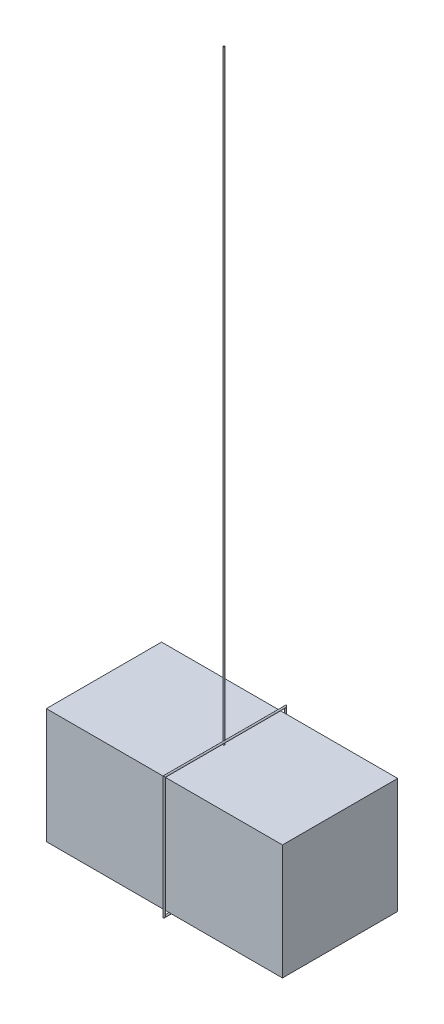
ISO-10303-21;
HEADER;
FILE_DESCRIPTION(('STEP AP214'),'2;1');
FILE_NAME('part.step','',(''),(''),'','','');
FILE_SCHEMA(('AUTOMOTIVE_DESIGN { 1 0 10303 214 1 1 1 1 }'));
ENDSEC;
DATA;
#1=APPLICATION_CONTEXT('core data for automotive mechanical design processes');
#2=APPLICATION_PROTOCOL_DEFINITION('international standard','automotive_design',2000,#1);
#3=PRODUCT_CONTEXT('',#1,'mechanical');
#4=PRODUCT('Part','Part','',(#3));
#5=PRODUCT_RELATED_PRODUCT_CATEGORY('part','',(#4));
#6=PRODUCT_DEFINITION_FORMATION('','',#4);
#7=PRODUCT_DEFINITION_CONTEXT('part definition',#1,'design');
#8=PRODUCT_DEFINITION('design','',#6,#7);
#9=PRODUCT_DEFINITION_SHAPE('','',#8);
#10=(LENGTH_UNIT() NAMED_UNIT(*) SI_UNIT(.MILLI.,.METRE.));
#11=(NAMED_UNIT(*) PLANE_ANGLE_UNIT() SI_UNIT($,.RADIAN.));
#12=(NAMED_UNIT(*) SI_UNIT($,.STERADIAN.) SOLID_ANGLE_UNIT());
#13=UNCERTAINTY_MEASURE_WITH_UNIT(LENGTH_MEASURE(1.E-05),#10,'distance_accuracy_value','');
#14=(GEOMETRIC_REPRESENTATION_CONTEXT(3) GLOBAL_UNCERTAINTY_ASSIGNED_CONTEXT((#13)) GLOBAL_UNIT_ASSIGNED_CONTEXT((#10,
#11,#12)) REPRESENTATION_CONTEXT('',''));
#15=CARTESIAN_POINT('',(0.,0.,0.));
#16=DIRECTION('',(0.,0.,1.));
#17=DIRECTION('',(1.,0.,0.));
#18=AXIS2_PLACEMENT_3D('',#15,#16,#17);
#19=CARTESIAN_POINT('',(0.,0.,48.41875));
#20=DIRECTION('',(0.,-1.,0.));
#21=DIRECTION('',(0.,0.,-1.));
#22=AXIS2_PLACEMENT_3D('',#19,#20,#21);
#23=PLANE('',#22);
#24=DIRECTION('',(-1.,0.,0.));
#25=VECTOR('',#24,1.);
#26=CARTESIAN_POINT('',(0.,0.,-48.41875));
#27=LINE('',#26,#25);
#28=CARTESIAN_POINT('',(198.4375,0.,-48.41875));
#29=VERTEX_POINT('',#28);
#30=CARTESIAN_POINT('',(0.,0.,-48.41875));
#31=VERTEX_POINT('',#30);
#32=EDGE_CURVE('E84',#29,#31,#27,.T.);
#33=ORIENTED_EDGE('',*,*,#32,.T.);
#34=DIRECTION('',(0.,0.,-1.));
#35=VECTOR('',#34,1.);
#36=CARTESIAN_POINT('',(0.,0.,48.41875));
#37=LINE('',#36,#35);
#38=CARTESIAN_POINT('',(0.,0.,48.41875));
#39=VERTEX_POINT('',#38);
#40=EDGE_CURVE('E107',#39,#31,#37,.T.);
#41=ORIENTED_EDGE('',*,*,#40,.F.);
#42=DIRECTION('',(-1.,0.,0.));
#43=VECTOR('',#42,1.);
#44=CARTESIAN_POINT('',(0.,0.,48.41875));
#45=LINE('',#44,#43);
#46=CARTESIAN_POINT('',(198.4375,0.,48.41875));
#47=VERTEX_POINT('',#46);
#48=EDGE_CURVE('E61',#47,#39,#45,.T.);
#49=ORIENTED_EDGE('',*,*,#48,.F.);
#50=DIRECTION('',(0.,0.,-1.));
#51=VECTOR('',#50,1.);
#52=CARTESIAN_POINT('',(198.4375,0.,48.41875));
#53=LINE('',#52,#51);
#54=EDGE_CURVE('E103',#47,#29,#53,.T.);
#55=ORIENTED_EDGE('',*,*,#54,.T.);
#56=EDGE_LOOP('',(#33,#41,#49,#55));
#57=FACE_BOUND('',#56,.T.);
#58=CARTESIAN_POINT('',(100.885550065813,0.,0.));
#59=DIRECTION('',(0.,-1.,0.));
#60=DIRECTION('',(0.,0.,-1.));
#61=AXIS2_PLACEMENT_3D('',#58,#59,#60);
#62=CIRCLE('',#61,0.635000000000002);
#63=CARTESIAN_POINT('',(100.885550065813,0.,-0.635000000000009));
#64=VERTEX_POINT('',#63);
#65=EDGE_CURVE('E12',#64,#64,#62,.F.);
#66=ORIENTED_EDGE('',*,*,#65,.F.);
#67=EDGE_LOOP('',(#66));
#68=FACE_BOUND('',#67,.T.);
#69=ADVANCED_FACE('F39',(#57,#68),#23,.F.);
#70=CARTESIAN_POINT('',(0.,-96.8375,48.41875));
#71=DIRECTION('',(1.,0.,0.));
#72=DIRECTION('',(0.,1.,0.));
#73=AXIS2_PLACEMENT_3D('',#70,#71,#72);
#74=PLANE('',#73);
#75=DIRECTION('',(0.,-1.,0.));
#76=VECTOR('',#75,1.);
#77=CARTESIAN_POINT('',(0.,-96.8375,-48.41875));
#78=LINE('',#77,#76);
#79=CARTESIAN_POINT('',(0.,-96.8375,-48.41875));
#80=VERTEX_POINT('',#79);
#81=EDGE_CURVE('E111',#31,#80,#78,.T.);
#82=ORIENTED_EDGE('',*,*,#81,.T.);
#83=DIRECTION('',(0.,0.,-1.));
#84=VECTOR('',#83,1.);
#85=CARTESIAN_POINT('',(0.,-96.8375,48.41875));
#86=LINE('',#85,#84);
#87=CARTESIAN_POINT('',(0.,-96.8375,48.41875));
#88=VERTEX_POINT('',#87);
#89=EDGE_CURVE('E53',#88,#80,#86,.T.);
#90=ORIENTED_EDGE('',*,*,#89,.F.);
#91=DIRECTION('',(0.,-1.,0.));
#92=VECTOR('',#91,1.);
#93=CARTESIAN_POINT('',(0.,-96.8375,48.41875));
#94=LINE('',#93,#92);
#95=EDGE_CURVE('E97',#39,#88,#94,.T.);
#96=ORIENTED_EDGE('',*,*,#95,.F.);
#97=ORIENTED_EDGE('',*,*,#40,.T.);
#98=EDGE_LOOP('',(#82,#90,#96,#97));
#99=FACE_BOUND('',#98,.T.);
#100=ADVANCED_FACE('F41',(#99),#74,.F.);
#101=CARTESIAN_POINT('',(198.4375,-96.8375,48.41875));
#102=DIRECTION('',(0.,1.,0.));
#103=DIRECTION('',(-1.,0.,0.));
#104=AXIS2_PLACEMENT_3D('',#101,#102,#103);
#105=PLANE('',#104);
#106=DIRECTION('',(1.,0.,0.));
#107=VECTOR('',#106,1.);
#108=CARTESIAN_POINT('',(198.4375,-96.8375,-48.41875));
#109=LINE('',#108,#107);
#110=CARTESIAN_POINT('',(198.4375,-96.8375,-48.41875));
#111=VERTEX_POINT('',#110);
#112=EDGE_CURVE('E102',#80,#111,#109,.T.);
#113=ORIENTED_EDGE('',*,*,#112,.T.);
#114=DIRECTION('',(0.,0.,-1.));
#115=VECTOR('',#114,1.);
#116=CARTESIAN_POINT('',(198.4375,-96.8375,48.41875));
#117=LINE('',#116,#115);
#118=CARTESIAN_POINT('',(198.4375,-96.8375,48.41875));
#119=VERTEX_POINT('',#118);
#120=EDGE_CURVE('E100',#119,#111,#117,.T.);
#121=ORIENTED_EDGE('',*,*,#120,.F.);
#122=DIRECTION('',(1.,0.,0.));
#123=VECTOR('',#122,1.);
#124=CARTESIAN_POINT('',(198.4375,-96.8375,48.41875));
#125=LINE('',#124,#123);
#126=EDGE_CURVE('E92',#88,#119,#125,.T.);
#127=ORIENTED_EDGE('',*,*,#126,.F.);
#128=ORIENTED_EDGE('',*,*,#89,.T.);
#129=EDGE_LOOP('',(#113,#121,#127,#128));
#130=FACE_BOUND('',#129,.T.);
#131=ADVANCED_FACE('F101',(#130),#105,.F.);
#132=CARTESIAN_POINT('',(198.4375,0.,48.41875));
#133=DIRECTION('',(-1.,0.,0.));
#134=DIRECTION('',(0.,-1.,0.));
#135=AXIS2_PLACEMENT_3D('',#132,#133,#134);
#136=PLANE('',#135);
#137=DIRECTION('',(0.,1.,0.));
#138=VECTOR('',#137,1.);
#139=CARTESIAN_POINT('',(198.4375,0.,-48.41875));
#140=LINE('',#139,#138);
#141=EDGE_CURVE('E78',#111,#29,#140,.T.);
#142=ORIENTED_EDGE('',*,*,#141,.T.);
#143=ORIENTED_EDGE('',*,*,#54,.F.);
#144=DIRECTION('',(0.,1.,0.));
#145=VECTOR('',#144,1.);
#146=CARTESIAN_POINT('',(198.4375,0.,48.41875));
#147=LINE('',#146,#145);
#148=EDGE_CURVE('E95',#119,#47,#147,.T.);
#149=ORIENTED_EDGE('',*,*,#148,.F.);
#150=ORIENTED_EDGE('',*,*,#120,.T.);
#151=EDGE_LOOP('',(#142,#143,#149,#150));
#152=FACE_BOUND('',#151,.T.);
#153=ADVANCED_FACE('F105',(#152),#136,.F.);
#154=CARTESIAN_POINT('',(0.,0.,48.41875));
#155=DIRECTION('',(0.,0.,-1.));
#156=DIRECTION('',(-1.,0.,0.));
#157=AXIS2_PLACEMENT_3D('',#154,#155,#156);
#158=PLANE('',#157);
#159=ORIENTED_EDGE('',*,*,#95,.T.);
#160=ORIENTED_EDGE('',*,*,#126,.T.);
#161=ORIENTED_EDGE('',*,*,#148,.T.);
#162=ORIENTED_EDGE('',*,*,#48,.T.);
#163=EDGE_LOOP('',(#159,#160,#161,#162));
#164=FACE_BOUND('',#163,.T.);
#165=ADVANCED_FACE('F93',(#164),#158,.F.);
#166=CARTESIAN_POINT('',(0.,0.,-48.41875));
#167=DIRECTION('',(0.,0.,-1.));
#168=DIRECTION('',(-1.,0.,0.));
#169=AXIS2_PLACEMENT_3D('',#166,#167,#168);
#170=PLANE('',#169);
#171=ORIENTED_EDGE('',*,*,#81,.F.);
#172=ORIENTED_EDGE('',*,*,#32,.F.);
#173=ORIENTED_EDGE('',*,*,#141,.F.);
#174=ORIENTED_EDGE('',*,*,#112,.F.);
#175=EDGE_LOOP('',(#171,#172,#173,#174));
#176=FACE_BOUND('',#175,.T.);
#177=ADVANCED_FACE('F123',(#176),#170,.T.);
#178=CARTESIAN_POINT('',(100.885550065813,508.,0.));
#179=DIRECTION('',(0.,-1.,0.));
#180=DIRECTION('',(0.,0.,-1.));
#181=AXIS2_PLACEMENT_3D('',#178,#179,#180);
#182=CYLINDRICAL_SURFACE('',#181,0.635000000000002);
#183=CARTESIAN_POINT('',(100.885550065813,2.53999999999999,-0.635000000000009));
#184=CARTESIAN_POINT('',(100.885551959947,2.50017637565072,-0.63500356820542));
#185=CARTESIAN_POINT('',(100.888891003326,2.46031973322274,-0.635027355153595));
#186=CARTESIAN_POINT('',(100.902172021249,2.38166462817366,-0.634815736052414));
#187=CARTESIAN_POINT('',(100.912125892734,2.34286820351116,-0.634579862494173));
#188=CARTESIAN_POINT('',(100.938381992971,2.26742351419813,-0.632935190108001));
#189=CARTESIAN_POINT('',(100.954695280736,2.23077912036083,-0.631524343119863));
#190=CARTESIAN_POINT('',(100.993121018318,2.16089622478168,-0.626120840421381));
#191=CARTESIAN_POINT('',(101.015224634128,2.12765264111828,-0.622132104179034));
#192=CARTESIAN_POINT('',(101.058982365274,2.0723394057664,-0.611178824837852));
#193=CARTESIAN_POINT('',(101.079735538612,2.04939590312925,-0.605025892244012));
#194=CARTESIAN_POINT('',(101.123331378876,2.0069443545692,-0.58925410171746));
#195=CARTESIAN_POINT('',(101.14617199888,1.98743299690796,-0.579638612478396));
#196=CARTESIAN_POINT('',(101.19285703255,1.9521794176325,-0.556300101974865));
#197=CARTESIAN_POINT('',(101.216705500294,1.93645454990927,-0.542558793901127));
#198=CARTESIAN_POINT('',(101.263847860301,1.9089801958581,-0.51080539565028));
#199=CARTESIAN_POINT('',(101.287141736221,1.89723082654119,-0.492793179793875));
#200=CARTESIAN_POINT('',(101.330096721919,1.87810570996459,-0.454283726507869));
#201=CARTESIAN_POINT('',(101.349899157221,1.87046979389216,-0.434070701877532));
#202=CARTESIAN_POINT('',(101.386937875565,1.85777767643675,-0.390703350876015));
#203=CARTESIAN_POINT('',(101.40417341717,1.85272221938843,-0.367548178243602));
#204=CARTESIAN_POINT('',(101.436345323334,1.8443356131638,-0.317467601979483));
#205=CARTESIAN_POINT('',(101.451093010352,1.8411200514932,-0.29040209920162));
#206=CARTESIAN_POINT('',(101.476545462056,1.83617754499422,-0.234306455423353));
#207=CARTESIAN_POINT('',(101.487248628191,1.83445118841229,-0.20527554295115));
#208=CARTESIAN_POINT('',(101.505170383658,1.83180699136644,-0.142990708609171));
#209=CARTESIAN_POINT('',(101.51194028815,1.83098586971899,-0.109602918096574));
#210=CARTESIAN_POINT('',(101.52005918104,1.83002482229415,-0.0421628915012378));
#211=CARTESIAN_POINT('',(101.521406823877,1.82988506559903,-0.00811049259899856));
#212=CARTESIAN_POINT('',(101.518585565203,1.83020210423538,0.0611606113125719));
#213=CARTESIAN_POINT('',(101.514189347573,1.83068347129299,0.0963702172652089));
#214=CARTESIAN_POINT('',(101.499607403511,1.83260089608067,0.165555558555355));
#215=CARTESIAN_POINT('',(101.489420092462,1.83403721513247,0.199530953467447));
#216=CARTESIAN_POINT('',(101.463620525547,1.83856593162005,0.265137423148049));
#217=CARTESIAN_POINT('',(101.448023834056,1.84165359133287,0.29677491131805));
#218=CARTESIAN_POINT('',(101.412011244787,1.85047801016728,0.356769795966312));
#219=CARTESIAN_POINT('',(101.391598666148,1.85621294736229,0.385129431591915));
#220=CARTESIAN_POINT('',(101.348364563512,1.87096654576606,0.435972707614612));
#221=CARTESIAN_POINT('',(101.325766348879,1.87976322805827,0.458709458700198));
#222=CARTESIAN_POINT('',(101.27857582056,1.90141169127791,0.499730789860662));
#223=CARTESIAN_POINT('',(101.253985506805,1.91425944179553,0.518019763135951));
#224=CARTESIAN_POINT('',(101.206981137451,1.94279611866656,0.548278760755047));
#225=CARTESIAN_POINT('',(101.184600166167,1.95806307007751,0.560702330197133));
#226=CARTESIAN_POINT('',(101.140748213598,1.99200800429934,0.581973861823191));
#227=CARTESIAN_POINT('',(101.119277468749,2.01068686676297,0.59082090001791));
#228=CARTESIAN_POINT('',(101.078100231816,2.05122501574871,0.605501582120765));
#229=CARTESIAN_POINT('',(101.058408007161,2.07310686505933,0.611312387753439));
#230=CARTESIAN_POINT('',(101.021682670725,2.11944851950367,0.620525606408067));
#231=CARTESIAN_POINT('',(101.004650792491,2.14390951177861,0.623926904760993));
#232=CARTESIAN_POINT('',(100.971531814244,2.19849749600965,0.629407196476561));
#233=CARTESIAN_POINT('',(100.955917785815,2.22893681664999,0.631231628773974));
#234=CARTESIAN_POINT('',(100.929185118431,2.29177751052621,0.63364123758893));
#235=CARTESIAN_POINT('',(100.918069107234,2.32418001799239,0.634225690549444));
#236=CARTESIAN_POINT('',(100.899403820378,2.3947179694275,0.634928142302998));
#237=CARTESIAN_POINT('',(100.892538400489,2.43303693558448,0.634972541208487));
#238=CARTESIAN_POINT('',(100.885113982486,2.51028062042856,0.635010557967519));
#239=CARTESIAN_POINT('',(100.884555967982,2.54920543264684,0.63500416790102));
#240=CARTESIAN_POINT('',(100.889851452593,2.62796643514098,0.634991542252829));
#241=CARTESIAN_POINT('',(100.89592592846,2.66778798034292,0.634985319525098));
#242=CARTESIAN_POINT('',(100.91467626352,2.74587137477681,0.634400195754417));
#243=CARTESIAN_POINT('',(100.927356342423,2.78413221014887,0.63382092843329));
#244=CARTESIAN_POINT('',(100.958904150623,2.85786721015812,0.630947071471457));
#245=CARTESIAN_POINT('',(100.977759303697,2.89334685847869,0.628655956146822));
#246=CARTESIAN_POINT('',(101.020947085116,2.96037694330585,0.620782079395262));
#247=CARTESIAN_POINT('',(101.045269863191,2.99193428925633,0.615205208534121));
#248=CARTESIAN_POINT('',(101.091758830064,3.04301670773707,0.600952694814135));
#249=CARTESIAN_POINT('',(101.11306534445,3.06361944271825,0.593327524196405));
#250=CARTESIAN_POINT('',(101.157112558233,3.10136244931812,0.574500111388773));
#251=CARTESIAN_POINT('',(101.179851935554,3.11850585314789,0.563301129002903));
#252=CARTESIAN_POINT('',(101.225612788217,3.14912563043316,0.536917741482403));
#253=CARTESIAN_POINT('',(101.248634886823,3.16259131480811,0.521721965964093));
#254=CARTESIAN_POINT('',(101.293560017667,3.18589096376585,0.487392919005396));
#255=CARTESIAN_POINT('',(101.315462715793,3.19572384944539,0.468258480446291));
#256=CARTESIAN_POINT('',(101.356055728653,3.21185396627391,0.427368889145243));
#257=CARTESIAN_POINT('',(101.374843991903,3.21828568743051,0.40576282028039));
#258=CARTESIAN_POINT('',(101.409538590291,3.22883427696417,0.359847182214388));
#259=CARTESIAN_POINT('',(101.425444045871,3.23295043965626,0.335536791550155));
#260=CARTESIAN_POINT('',(101.454978003659,3.23975422169696,0.282775610243191));
#261=CARTESIAN_POINT('',(101.468324626379,3.24230211138425,0.254149286485311));
#262=CARTESIAN_POINT('',(101.490640460429,3.24612147726086,0.19515779028261));
#263=CARTESIAN_POINT('',(101.49960797106,3.24739245774387,0.164791947374241));
#264=CARTESIAN_POINT('',(101.513530007719,3.24923664072267,0.100255137590423));
#265=CARTESIAN_POINT('',(101.518050479921,3.2497367073608,0.0659877462425562));
#266=CARTESIAN_POINT('',(101.521478411727,3.250123799189,-0.00283332368474684));
#267=CARTESIAN_POINT('',(101.520384567231,3.25001068194782,-0.0373870669172067));
#268=CARTESIAN_POINT('',(101.51250131965,3.24908330111502,-0.106826774948559));
#269=CARTESIAN_POINT('',(101.505551519929,3.24824927477752,-0.141694442393204));
#270=CARTESIAN_POINT('',(101.485952612853,3.24535756833111,-0.209751248803523));
#271=CARTESIAN_POINT('',(101.47330229419,3.24329962812178,-0.242940029352841));
#272=CARTESIAN_POINT('',(101.442915955451,3.23713701931412,-0.306245433260778));
#273=CARTESIAN_POINT('',(101.425239234437,3.23305582542638,-0.336392627137607));
#274=CARTESIAN_POINT('',(101.385516399809,3.22180549953961,-0.393001945236934));
#275=CARTESIAN_POINT('',(101.363474669637,3.21463945701034,-0.419467721396969));
#276=CARTESIAN_POINT('',(101.318116953689,3.19690542956367,-0.465920349326568));
#277=CARTESIAN_POINT('',(101.29503371571,3.18664567851751,-0.486251166431974));
#278=CARTESIAN_POINT('',(101.247616296071,3.16207250566533,-0.522515795554033));
#279=CARTESIAN_POINT('',(101.22328295209,3.14776177010358,-0.538452507563469));
#280=CARTESIAN_POINT('',(101.177139243714,3.11648355455116,-0.564661071152368));
#281=CARTESIAN_POINT('',(101.155300234012,3.09987479876367,-0.575315638403351));
#282=CARTESIAN_POINT('',(101.112969110091,3.06346855351691,-0.593325785949092));
#283=CARTESIAN_POINT('',(101.092477370934,3.0436701813604,-0.600680450887279));
#284=CARTESIAN_POINT('',(101.052869670966,3.00041668672925,-0.612925780508658));
#285=CARTESIAN_POINT('',(101.033848627065,2.97684227317705,-0.617699002950806));
#286=CARTESIAN_POINT('',(100.998824501224,2.9272346717134,-0.62507192065374));
#287=CARTESIAN_POINT('',(100.982823815303,2.90119955611706,-0.627669895879765));
#288=CARTESIAN_POINT('',(100.952043982199,2.84304254732079,-0.631728931832186));
#289=CARTESIAN_POINT('',(100.937836003878,2.81060187086303,-0.632952167433685));
#290=CARTESIAN_POINT('',(100.91437872882,2.74398184932303,-0.634454801442635));
#291=CARTESIAN_POINT('',(100.905125995969,2.70980372709118,-0.634734854595458));
#292=CARTESIAN_POINT('',(100.894160844283,2.65289063129881,-0.634955113617069));
#293=CARTESIAN_POINT('',(100.890935064092,2.63043652274165,-0.634981061114806));
#294=CARTESIAN_POINT('',(100.886629139368,2.58532517493417,-0.635002488729291));
#295=CARTESIAN_POINT('',(100.885548987657,2.56266793636373,-0.634997968947976));
#296=CARTESIAN_POINT('',(100.885550065813,2.53999999999999,-0.635000000000009));
#297=B_SPLINE_CURVE_WITH_KNOTS('',3,(#183,#184,#185,#186,#187,#188,#189,#190,#191,#192,#193,
#194,#195,#196,#197,#198,#199,#200,#201,#202,#203,#204,#205,#206,#207,#208,#209,#210,#211,#212,
#213,#214,#215,#216,#217,#218,#219,#220,#221,#222,#223,#224,#225,#226,#227,#228,#229,#230,#231,
#232,#233,#234,#235,#236,#237,#238,#239,#240,#241,#242,#243,#244,#245,#246,#247,#248,#249,#250,
#251,#252,#253,#254,#255,#256,#257,#258,#259,#260,#261,#262,#263,#264,#265,#266,#267,#268,#269,
#270,#271,#272,#273,#274,#275,#276,#277,#278,#279,#280,#281,#282,#283,#284,#285,#286,#287,#288,
#289,#290,#291,#292,#293,#294,#295,#296),.UNSPECIFIED.,.T.,.F.,(4,2,2,2,2,2,2,2,2,2,2,2,2,2,2,2,
2,2,2,2,2,2,2,2,2,2,2,2,2,2,2,2,2,2,2,2,2,2,2,2,2,2,2,2,2,2,2,2,2,2,2,2,2,2,2,2,4),(0.,
0.119389888424233,0.238995085896408,0.358809211163133,0.478441596127773,0.572674252307582,
0.666815476887072,0.761380281461995,0.855947869125151,0.943486530572828,1.03105042834045,
1.12363881124759,1.21626375049006,1.3180388814051,1.41983926676627,1.52579306747709,
1.63177587428889,1.737456233172,1.84306396822052,1.94222082915069,2.04127934849765,
2.13026099248813,2.2192656100291,2.30893040985137,2.39863666272216,2.50101094816602,
2.60344495499516,2.71970376538325,2.8359807055505,2.9562532521513,3.07660272416399,
3.19670859968885,3.31659980678403,3.40801803031077,3.49935310514529,3.59095088152442,
3.68257583965919,3.77023917930036,3.85792922059255,3.95259673562399,4.04730098715383,
4.1505328011898,4.25378859509078,4.35996814776414,4.46617027328398,4.57116805814656,
4.67606093168712,4.77278877784409,4.86945263254756,4.95734851692442,5.04526876760136,
5.13690962310976,5.22862287360493,5.33451326826157,5.44033013997221,5.50828807932125,
5.57624579129493),.UNSPECIFIED.);
#298=CARTESIAN_POINT('',(100.885550065813,2.53999999999999,-0.635000000000009));
#299=VERTEX_POINT('',#298);
#300=EDGE_CURVE('E43',#299,#299,#297,.T.);
#301=ORIENTED_EDGE('',*,*,#300,.T.);
#302=EDGE_LOOP('',(#301));
#303=FACE_BOUND('',#302,.T.);
#304=CARTESIAN_POINT('',(100.885550065813,508.,0.));
#305=DIRECTION('',(0.,1.,0.));
#306=DIRECTION('',(0.,0.,1.));
#307=AXIS2_PLACEMENT_3D('',#304,#305,#306);
#308=CIRCLE('',#307,0.635000000000002);
#309=CARTESIAN_POINT('',(100.885550065813,508.,0.634999999999995));
#310=VERTEX_POINT('',#309);
#311=EDGE_CURVE('E114',#310,#310,#308,.T.);
#312=ORIENTED_EDGE('',*,*,#311,.F.);
#313=EDGE_LOOP('',(#312));
#314=FACE_BOUND('',#313,.T.);
#315=ORIENTED_EDGE('',*,*,#65,.T.);
#316=EDGE_LOOP('',(#315));
#317=FACE_BOUND('',#316,.T.);
#318=ADVANCED_FACE('F125',(#303,#314,#317),#182,.T.);
#319=CARTESIAN_POINT('',(100.885550065813,508.,0.));
#320=DIRECTION('',(0.,1.,0.));
#321=DIRECTION('',(0.,0.,1.));
#322=AXIS2_PLACEMENT_3D('',#319,#320,#321);
#323=PLANE('',#322);
#324=ORIENTED_EDGE('',*,*,#311,.T.);
#325=EDGE_LOOP('',(#324));
#326=FACE_BOUND('',#325,.T.);
#327=ADVANCED_FACE('F131',(#326),#323,.T.);
#328=CARTESIAN_POINT('',(101.6,2.54,-55.0002891462536));
#329=DIRECTION('',(0.,0.,1.));
#330=DIRECTION('',(1.,0.,0.));
#331=AXIS2_PLACEMENT_3D('',#328,#329,#330);
#332=CYLINDRICAL_SURFACE('',#331,0.714449934186703);
#333=CARTESIAN_POINT('',(101.6,2.53999999999997,50.95875));
#334=DIRECTION('',(0.,0.707106781186547,-0.707106781186548));
#335=DIRECTION('',(0.,0.707106781186548,0.707106781186547));
#336=AXIS2_PLACEMENT_3D('',#333,#334,#335);
#337=ELLIPSE('',#336,1.0103847865634,0.714449934186703);
#338=CARTESIAN_POINT('',(101.6,3.25444993418668,51.6731999341867));
#339=VERTEX_POINT('',#338);
#340=EDGE_CURVE('E253',#339,#339,#337,.T.);
#341=ORIENTED_EDGE('',*,*,#340,.T.);
#342=EDGE_LOOP('',(#341));
#343=FACE_BOUND('',#342,.T.);
#344=CARTESIAN_POINT('',(101.6,2.54,-50.95875));
#345=DIRECTION('',(0.,-0.707106781186548,-0.707106781186548));
#346=DIRECTION('',(0.,-0.707106781186548,0.707106781186548));
#347=AXIS2_PLACEMENT_3D('',#344,#345,#346);
#348=ELLIPSE('',#347,1.0103847865634,0.714449934186703);
#349=CARTESIAN_POINT('',(101.6,1.8255500658133,-50.2443000658133));
#350=VERTEX_POINT('',#349);
#351=EDGE_CURVE('E246',#350,#350,#348,.F.);
#352=ORIENTED_EDGE('',*,*,#351,.T.);
#353=EDGE_LOOP('',(#352));
#354=FACE_BOUND('',#353,.T.);
#355=ORIENTED_EDGE('',*,*,#300,.F.);
#356=EDGE_LOOP('',(#355));
#357=FACE_BOUND('',#356,.T.);
#358=ADVANCED_FACE('F174',(#343,#354,#357),#332,.T.);
#359=CARTESIAN_POINT('',(101.6,-99.3775,50.95875));
#360=DIRECTION('',(0.,1.,0.));
#361=DIRECTION('',(0.,0.,1.));
#362=AXIS2_PLACEMENT_3D('',#359,#360,#361);
#363=CYLINDRICAL_SURFACE('',#362,0.714449934186703);
#364=CARTESIAN_POINT('',(101.6,-99.3775,50.95875));
#365=DIRECTION('',(0.,0.707106781186548,0.707106781186547));
#366=DIRECTION('',(0.,-0.707106781186547,0.707106781186548));
#367=AXIS2_PLACEMENT_3D('',#364,#365,#366);
#368=ELLIPSE('',#367,1.0103847865634,0.714449934186703);
#369=CARTESIAN_POINT('',(101.6,-100.091949934187,51.6731999341867));
#370=VERTEX_POINT('',#369);
#371=EDGE_CURVE('E250',#370,#370,#368,.F.);
#372=ORIENTED_EDGE('',*,*,#371,.F.);
#373=EDGE_LOOP('',(#372));
#374=FACE_BOUND('',#373,.T.);
#375=ORIENTED_EDGE('',*,*,#340,.F.);
#376=EDGE_LOOP('',(#375));
#377=FACE_BOUND('',#376,.T.);
#378=ADVANCED_FACE('F182',(#374,#377),#363,.T.);
#379=CARTESIAN_POINT('',(101.6,-99.3775,-50.95875));
#380=DIRECTION('',(0.,0.,1.));
#381=DIRECTION('',(1.,0.,0.));
#382=AXIS2_PLACEMENT_3D('',#379,#380,#381);
#383=CYLINDRICAL_SURFACE('',#382,0.714449934186703);
#384=CARTESIAN_POINT('',(101.6,-99.3775,-50.95875));
#385=DIRECTION('',(0.,-0.707106781186548,0.707106781186548));
#386=DIRECTION('',(0.,-0.707106781186548,-0.707106781186548));
#387=AXIS2_PLACEMENT_3D('',#384,#385,#386);
#388=ELLIPSE('',#387,1.0103847865634,0.714449934186703);
#389=CARTESIAN_POINT('',(101.6,-100.091949934187,-51.6731999341867));
#390=VERTEX_POINT('',#389);
#391=EDGE_CURVE('E249',#390,#390,#388,.T.);
#392=ORIENTED_EDGE('',*,*,#391,.T.);
#393=EDGE_LOOP('',(#392));
#394=FACE_BOUND('',#393,.T.);
#395=ORIENTED_EDGE('',*,*,#371,.T.);
#396=EDGE_LOOP('',(#395));
#397=FACE_BOUND('',#396,.T.);
#398=ADVANCED_FACE('F189',(#394,#397),#383,.T.);
#399=CARTESIAN_POINT('',(101.6,2.54,-50.95875));
#400=DIRECTION('',(0.,-1.,0.));
#401=DIRECTION('',(0.,0.,-1.));
#402=AXIS2_PLACEMENT_3D('',#399,#400,#401);
#403=CYLINDRICAL_SURFACE('',#402,0.714449934186703);
#404=ORIENTED_EDGE('',*,*,#351,.F.);
#405=EDGE_LOOP('',(#404));
#406=FACE_BOUND('',#405,.T.);
#407=ORIENTED_EDGE('',*,*,#391,.F.);
#408=EDGE_LOOP('',(#407));
#409=FACE_BOUND('',#408,.T.);
#410=ADVANCED_FACE('F197',(#406,#409),#403,.T.);
#411=CLOSED_SHELL('',(#69,#100,#131,#153,#165,#177,#318,#327,#358,#378,#398,#410));
#412=MANIFOLD_SOLID_BREP('B2',#411);
#413=ADVANCED_BREP_SHAPE_REPRESENTATION('',(#18,#412),#14);
#414=SHAPE_DEFINITION_REPRESENTATION(#9,#413);
ENDSEC;
END-ISO-10303-21;
